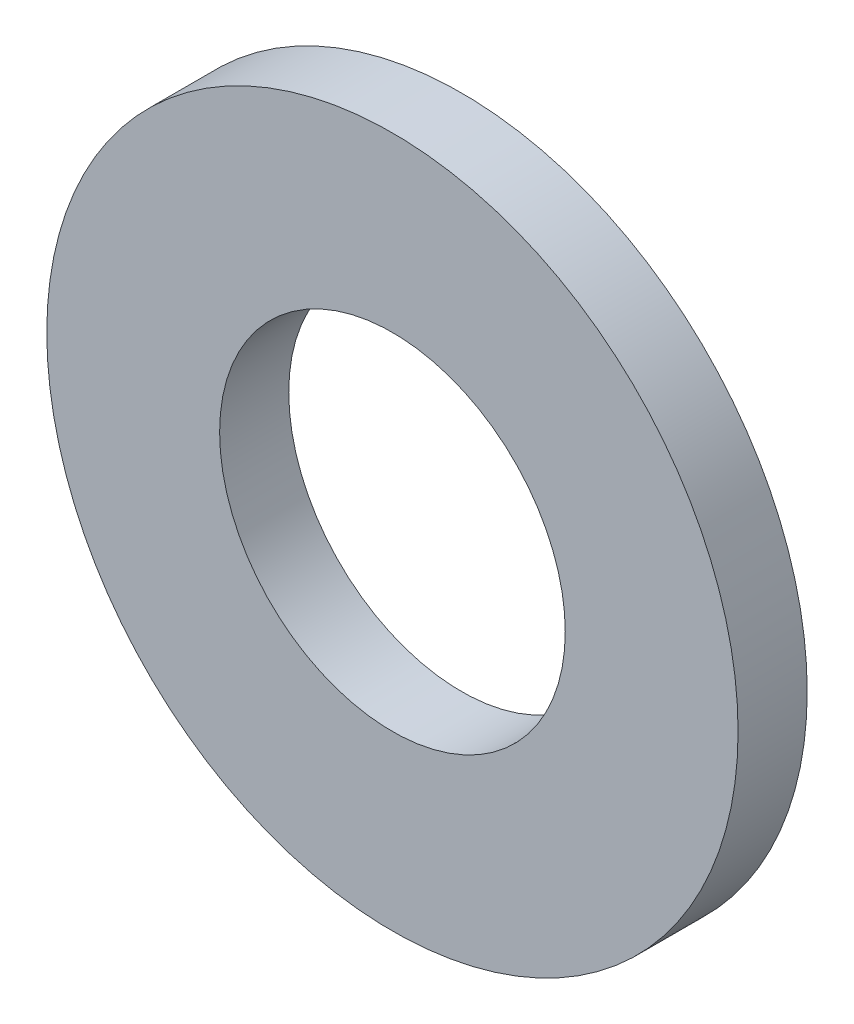
ISO-10303-21;
HEADER;
FILE_DESCRIPTION(('STEP AP214'),'2;1');
FILE_NAME('part.step','',(''),(''),'','','');
FILE_SCHEMA(('AUTOMOTIVE_DESIGN { 1 0 10303 214 1 1 1 1 }'));
ENDSEC;
DATA;
#1=APPLICATION_CONTEXT('core data for automotive mechanical design processes');
#2=APPLICATION_PROTOCOL_DEFINITION('international standard','automotive_design',2000,#1);
#3=PRODUCT_CONTEXT('',#1,'mechanical');
#4=PRODUCT('Part','Part','',(#3));
#5=PRODUCT_RELATED_PRODUCT_CATEGORY('part','',(#4));
#6=PRODUCT_DEFINITION_FORMATION('','',#4);
#7=PRODUCT_DEFINITION_CONTEXT('part definition',#1,'design');
#8=PRODUCT_DEFINITION('design','',#6,#7);
#9=PRODUCT_DEFINITION_SHAPE('','',#8);
#10=(LENGTH_UNIT() NAMED_UNIT(*) SI_UNIT(.MILLI.,.METRE.));
#11=(NAMED_UNIT(*) PLANE_ANGLE_UNIT() SI_UNIT($,.RADIAN.));
#12=(NAMED_UNIT(*) SI_UNIT($,.STERADIAN.) SOLID_ANGLE_UNIT());
#13=UNCERTAINTY_MEASURE_WITH_UNIT(LENGTH_MEASURE(1.E-05),#10,'distance_accuracy_value','');
#14=(GEOMETRIC_REPRESENTATION_CONTEXT(3) GLOBAL_UNCERTAINTY_ASSIGNED_CONTEXT((#13)) GLOBAL_UNIT_ASSIGNED_CONTEXT((#10,
#11,#12)) REPRESENTATION_CONTEXT('',''));
#15=CARTESIAN_POINT('',(0.,0.,0.));
#16=DIRECTION('',(0.,0.,1.));
#17=DIRECTION('',(1.,0.,0.));
#18=AXIS2_PLACEMENT_3D('',#15,#16,#17);
#19=CARTESIAN_POINT('',(0.,0.,0.4));
#20=DIRECTION('',(0.,0.,1.));
#21=DIRECTION('',(1.,0.,0.));
#22=AXIS2_PLACEMENT_3D('',#19,#20,#21);
#23=PLANE('',#22);
#24=CARTESIAN_POINT('',(0.,0.,0.4));
#25=DIRECTION('',(0.,0.,1.));
#26=DIRECTION('',(1.,0.,0.));
#27=AXIS2_PLACEMENT_3D('',#24,#25,#26);
#28=CIRCLE('',#27,2.);
#29=CARTESIAN_POINT('',(2.,0.,0.4));
#30=VERTEX_POINT('',#29);
#31=EDGE_CURVE('E10',#30,#30,#28,.T.);
#32=ORIENTED_EDGE('',*,*,#31,.T.);
#33=EDGE_LOOP('',(#32));
#34=FACE_BOUND('',#33,.T.);
#35=CARTESIAN_POINT('',(0.,0.,0.4));
#36=DIRECTION('',(0.,0.,1.));
#37=DIRECTION('',(1.,0.,0.));
#38=AXIS2_PLACEMENT_3D('',#35,#36,#37);
#39=CIRCLE('',#38,1.);
#40=CARTESIAN_POINT('',(1.,0.,0.4));
#41=VERTEX_POINT('',#40);
#42=EDGE_CURVE('E41',#41,#41,#39,.T.);
#43=ORIENTED_EDGE('',*,*,#42,.F.);
#44=EDGE_LOOP('',(#43));
#45=FACE_BOUND('',#44,.T.);
#46=ADVANCED_FACE('F30',(#34,#45),#23,.T.);
#47=CARTESIAN_POINT('',(0.,0.,0.));
#48=DIRECTION('',(0.,0.,1.));
#49=DIRECTION('',(1.,0.,0.));
#50=AXIS2_PLACEMENT_3D('',#47,#48,#49);
#51=PLANE('',#50);
#52=CARTESIAN_POINT('',(0.,0.,0.));
#53=DIRECTION('',(0.,0.,1.));
#54=DIRECTION('',(1.,0.,0.));
#55=AXIS2_PLACEMENT_3D('',#52,#53,#54);
#56=CIRCLE('',#55,2.);
#57=CARTESIAN_POINT('',(2.,0.,0.));
#58=VERTEX_POINT('',#57);
#59=EDGE_CURVE('E34',#58,#58,#56,.T.);
#60=ORIENTED_EDGE('',*,*,#59,.F.);
#61=EDGE_LOOP('',(#60));
#62=FACE_BOUND('',#61,.T.);
#63=CARTESIAN_POINT('',(0.,0.,0.));
#64=DIRECTION('',(0.,0.,1.));
#65=DIRECTION('',(1.,0.,0.));
#66=AXIS2_PLACEMENT_3D('',#63,#64,#65);
#67=CIRCLE('',#66,1.);
#68=CARTESIAN_POINT('',(1.,0.,0.));
#69=VERTEX_POINT('',#68);
#70=EDGE_CURVE('E43',#69,#69,#67,.T.);
#71=ORIENTED_EDGE('',*,*,#70,.T.);
#72=EDGE_LOOP('',(#71));
#73=FACE_BOUND('',#72,.T.);
#74=ADVANCED_FACE('F53',(#62,#73),#51,.F.);
#75=CARTESIAN_POINT('',(0.,0.,0.4));
#76=DIRECTION('',(0.,0.,-1.));
#77=DIRECTION('',(-1.,0.,0.));
#78=AXIS2_PLACEMENT_3D('',#75,#76,#77);
#79=CYLINDRICAL_SURFACE('',#78,2.);
#80=ORIENTED_EDGE('',*,*,#31,.F.);
#81=EDGE_LOOP('',(#80));
#82=FACE_BOUND('',#81,.T.);
#83=ORIENTED_EDGE('',*,*,#59,.T.);
#84=EDGE_LOOP('',(#83));
#85=FACE_BOUND('',#84,.T.);
#86=ADVANCED_FACE('F32',(#82,#85),#79,.T.);
#87=CARTESIAN_POINT('',(0.,0.,0.4));
#88=DIRECTION('',(0.,0.,-1.));
#89=DIRECTION('',(-1.,0.,0.));
#90=AXIS2_PLACEMENT_3D('',#87,#88,#89);
#91=CYLINDRICAL_SURFACE('',#90,1.);
#92=ORIENTED_EDGE('',*,*,#42,.T.);
#93=EDGE_LOOP('',(#92));
#94=FACE_BOUND('',#93,.T.);
#95=ORIENTED_EDGE('',*,*,#70,.F.);
#96=EDGE_LOOP('',(#95));
#97=FACE_BOUND('',#96,.T.);
#98=ADVANCED_FACE('F49',(#94,#97),#91,.F.);
#99=CLOSED_SHELL('',(#46,#74,#86,#98));
#100=MANIFOLD_SOLID_BREP('B2',#99);
#101=ADVANCED_BREP_SHAPE_REPRESENTATION('',(#18,#100),#14);
#102=SHAPE_DEFINITION_REPRESENTATION(#9,#101);
ENDSEC;
END-ISO-10303-21;
